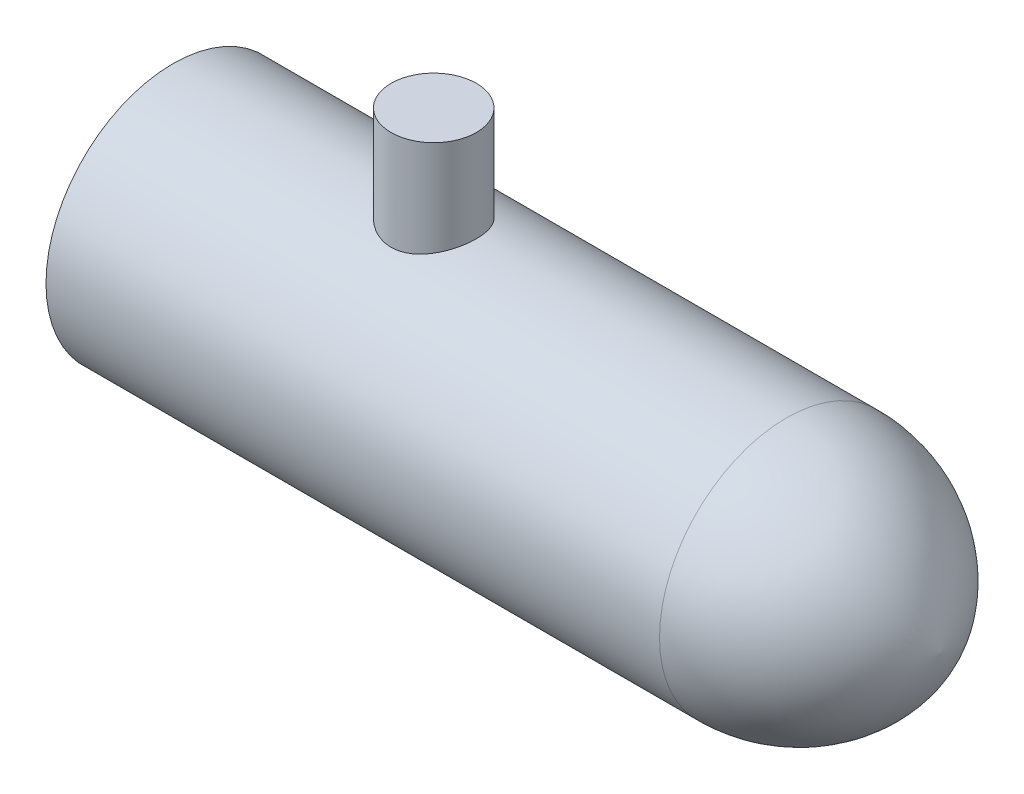
ISO-10303-21;
HEADER;
FILE_DESCRIPTION(('STEP AP214'),'2;1');
FILE_NAME('part.step','',(''),(''),'','','');
FILE_SCHEMA(('AUTOMOTIVE_DESIGN { 1 0 10303 214 1 1 1 1 }'));
ENDSEC;
DATA;
#1=APPLICATION_CONTEXT('core data for automotive mechanical design processes');
#2=APPLICATION_PROTOCOL_DEFINITION('international standard','automotive_design',2000,#1);
#3=PRODUCT_CONTEXT('',#1,'mechanical');
#4=PRODUCT('Part','Part','',(#3));
#5=PRODUCT_RELATED_PRODUCT_CATEGORY('part','',(#4));
#6=PRODUCT_DEFINITION_FORMATION('','',#4);
#7=PRODUCT_DEFINITION_CONTEXT('part definition',#1,'design');
#8=PRODUCT_DEFINITION('design','',#6,#7);
#9=PRODUCT_DEFINITION_SHAPE('','',#8);
#10=(LENGTH_UNIT() NAMED_UNIT(*) SI_UNIT(.MILLI.,.METRE.));
#11=(NAMED_UNIT(*) PLANE_ANGLE_UNIT() SI_UNIT($,.RADIAN.));
#12=(NAMED_UNIT(*) SI_UNIT($,.STERADIAN.) SOLID_ANGLE_UNIT());
#13=UNCERTAINTY_MEASURE_WITH_UNIT(LENGTH_MEASURE(1.E-05),#10,'distance_accuracy_value','');
#14=(GEOMETRIC_REPRESENTATION_CONTEXT(3) GLOBAL_UNCERTAINTY_ASSIGNED_CONTEXT((#13)) GLOBAL_UNIT_ASSIGNED_CONTEXT((#10,
#11,#12)) REPRESENTATION_CONTEXT('',''));
#15=CARTESIAN_POINT('',(0.,0.,0.));
#16=DIRECTION('',(0.,0.,1.));
#17=DIRECTION('',(1.,0.,0.));
#18=AXIS2_PLACEMENT_3D('',#15,#16,#17);
#19=CARTESIAN_POINT('',(127.,0.,0.));
#20=DIRECTION('',(-1.,0.,0.));
#21=DIRECTION('',(0.,0.,1.));
#22=AXIS2_PLACEMENT_3D('',#19,#20,#21);
#23=CYLINDRICAL_SURFACE('',#22,52.5526);
#24=CARTESIAN_POINT('',(-127.,0.,0.));
#25=DIRECTION('',(1.,0.,0.));
#26=DIRECTION('',(0.,0.,-1.));
#27=AXIS2_PLACEMENT_3D('',#24,#25,#26);
#28=CIRCLE('',#27,52.5526);
#29=CARTESIAN_POINT('',(-127.,0.,-52.5526));
#30=VERTEX_POINT('',#29);
#31=EDGE_CURVE('E66',#30,#30,#28,.T.);
#32=ORIENTED_EDGE('',*,*,#31,.T.);
#33=EDGE_LOOP('',(#32));
#34=FACE_BOUND('',#33,.T.);
#35=CARTESIAN_POINT('',(127.,0.,0.));
#36=DIRECTION('',(1.,0.,0.));
#37=DIRECTION('',(0.,0.,-1.));
#38=AXIS2_PLACEMENT_3D('',#35,#36,#37);
#39=CIRCLE('',#38,52.5526);
#40=CARTESIAN_POINT('',(127.,0.,-52.5526));
#41=VERTEX_POINT('',#40);
#42=EDGE_CURVE('E42',#41,#41,#39,.T.);
#43=ORIENTED_EDGE('',*,*,#42,.F.);
#44=EDGE_LOOP('',(#43));
#45=FACE_BOUND('',#44,.T.);
#46=CARTESIAN_POINT('',(-19.05,49.4989631988388,-17.653));
#47=CARTESIAN_POINT('',(-19.5305260048228,49.4989629532324,-17.6530003082304));
#48=CARTESIAN_POINT('',(-20.0110474586586,49.5059794142483,-17.6333633960385));
#49=CARTESIAN_POINT('',(-20.9684821638935,49.5338162332793,-17.5550145880757));
#50=CARTESIAN_POINT('',(-21.4453954572483,49.5546364305336,-17.4963031473733));
#51=CARTESIAN_POINT('',(-22.3921661941269,49.6094147409097,-17.3403732483805));
#52=CARTESIAN_POINT('',(-22.8620227875716,49.6433744238885,-17.2431501888318));
#53=CARTESIAN_POINT('',(-23.7912995671936,49.7233642483415,-17.0111095856218));
#54=CARTESIAN_POINT('',(-24.2507196509257,49.7693945082454,-16.8762916731));
#55=CARTESIAN_POINT('',(-25.1551030493514,49.8720178528158,-16.5705618405421));
#56=CARTESIAN_POINT('',(-25.6000938737013,49.9285892577525,-16.3997239088519));
#57=CARTESIAN_POINT('',(-26.4737745049151,50.0507007402627,-16.0231790848202));
#58=CARTESIAN_POINT('',(-26.9024643654421,50.116240788308,-15.8174723072796));
#59=CARTESIAN_POINT('',(-27.7410381403015,50.2544566606239,-15.372688975609));
#60=CARTESIAN_POINT('',(-28.1509191440249,50.3271335838751,-15.1336072798026));
#61=CARTESIAN_POINT('',(-28.9494721893862,50.477649546087,-14.6237240047705));
#62=CARTESIAN_POINT('',(-29.3381429208039,50.5554889032896,-14.3529204692383));
#63=CARTESIAN_POINT('',(-30.105689106652,50.7171550755363,-13.7709974847895));
#64=CARTESIAN_POINT('',(-30.4837053213106,50.8010965881028,-13.4587760333103));
#65=CARTESIAN_POINT('',(-31.2123521024094,50.9700356497915,-12.8041200380869));
#66=CARTESIAN_POINT('',(-31.5629820891438,51.055033221224,-12.4616848551115));
#67=CARTESIAN_POINT('',(-32.2347668620751,51.2238195890739,-11.748629782362));
#68=CARTESIAN_POINT('',(-32.5559164399133,51.3076081697011,-11.3780049333358));
#69=CARTESIAN_POINT('',(-33.166598905442,51.4717320940753,-10.6108622952378));
#70=CARTESIAN_POINT('',(-33.4561327432055,51.552067541547,-10.2143452848142));
#71=CARTESIAN_POINT('',(-34.0088870602722,51.7092212805486,-9.38691533446949));
#72=CARTESIAN_POINT('',(-34.2712013772305,51.7858889187284,-8.95536758787141));
#73=CARTESIAN_POINT('',(-34.7583930256163,51.9311744843795,-8.07031378102594));
#74=CARTESIAN_POINT('',(-34.9832694983149,51.9997922271961,-7.61680721740708));
#75=CARTESIAN_POINT('',(-35.3936366556601,52.1269963633454,-6.69105653530741));
#76=CARTESIAN_POINT('',(-35.5791356845668,52.1855848814061,-6.21881641177716));
#77=CARTESIAN_POINT('',(-35.9091060056045,52.2910350591554,-5.25894263959737));
#78=CARTESIAN_POINT('',(-36.0535790839836,52.3378972293924,-4.77130966217203));
#79=CARTESIAN_POINT('',(-36.2957404579975,52.4170802315864,-3.80179177378046));
#80=CARTESIAN_POINT('',(-36.3948997345633,52.4498558261846,-3.32031120238063));
#81=CARTESIAN_POINT('',(-36.5527770729487,52.5022761670325,-2.3500553748456));
#82=CARTESIAN_POINT('',(-36.6114960009825,52.5219211945329,-1.86128027518505));
#83=CARTESIAN_POINT('',(-36.6878996032651,52.5475171877741,-0.880285902860969));
#84=CARTESIAN_POINT('',(-36.7055935077917,52.5534712338656,-0.388067429929154));
#85=CARTESIAN_POINT('',(-36.6997936331135,52.5515229015678,0.596093465590439));
#86=CARTESIAN_POINT('',(-36.676300824031,52.5436208495485,1.08803589440721));
#87=CARTESIAN_POINT('',(-36.5901262788203,52.5147772968123,2.04827139178186));
#88=CARTESIAN_POINT('',(-36.5290448840084,52.4943684179944,2.51672515757799));
#89=CARTESIAN_POINT('',(-36.3697032119262,52.4415277285783,3.44655975563729));
#90=CARTESIAN_POINT('',(-36.2714441011002,52.4090962951862,3.90794080933304));
#91=CARTESIAN_POINT('',(-36.0386096296896,52.3330499850577,4.82051035603774));
#92=CARTESIAN_POINT('',(-35.9040329213144,52.2894346932775,5.27169847010062));
#93=CARTESIAN_POINT('',(-35.5996906935615,52.1921339319114,6.16092522971633));
#94=CARTESIAN_POINT('',(-35.429924384959,52.1384482364712,6.59896358009681));
#95=CARTESIAN_POINT('',(-35.054069474846,52.0215848095426,7.46484160145619));
#96=CARTESIAN_POINT('',(-34.8475305644515,51.9582910271362,7.89247002884542));
#97=CARTESIAN_POINT('',(-34.4012494717337,51.8243468694953,8.72881566924354));
#98=CARTESIAN_POINT('',(-34.1615071654825,51.7536964668033,9.13753281166059));
#99=CARTESIAN_POINT('',(-33.6504292948141,51.6067824374806,9.93376677166329));
#100=CARTESIAN_POINT('',(-33.3790868818001,51.5305175953716,10.3212789667157));
#101=CARTESIAN_POINT('',(-32.8065910408146,51.3742672079718,11.072840123111));
#102=CARTESIAN_POINT('',(-32.5054358712761,51.2942814454615,11.4368877116723));
#103=CARTESIAN_POINT('',(-31.8600697664396,51.1286945292606,12.1562756413503));
#104=CARTESIAN_POINT('',(-31.5144890371448,51.043007688898,12.5103685350521));
#105=CARTESIAN_POINT('',(-30.7947776857458,50.8720453028093,13.1883676350565));
#106=CARTESIAN_POINT('',(-30.4206461496407,50.7867697703435,13.5122728742194));
#107=CARTESIAN_POINT('',(-29.6460550877503,50.6189765870499,14.1278731592793));
#108=CARTESIAN_POINT('',(-29.2455907077052,50.5364594489639,14.4195622396656));
#109=CARTESIAN_POINT('',(-28.4208603148094,50.376549804956,14.9686604079249));
#110=CARTESIAN_POINT('',(-27.9965953481441,50.2991570741098,15.2260710008773));
#111=CARTESIAN_POINT('',(-27.1204628721498,50.1506794767551,15.7082694432515));
#112=CARTESIAN_POINT('',(-26.6682802770921,50.0797046328007,15.9325194311845));
#113=CARTESIAN_POINT('',(-25.7451373823873,49.9476084178934,16.341924187645));
#114=CARTESIAN_POINT('',(-25.2741767929538,49.8864871990775,16.5270783525588));
#115=CARTESIAN_POINT('',(-24.3169982366921,49.776126325458,16.8565483599118));
#116=CARTESIAN_POINT('',(-23.8307856778713,49.7268825118225,17.0008784998068));
#117=CARTESIAN_POINT('',(-22.8466282890408,49.6419328248548,17.2473565736121));
#118=CARTESIAN_POINT('',(-22.348684076878,49.6062262402705,17.3495067237036));
#119=CARTESIAN_POINT('',(-21.3679931030143,49.5509014474553,17.5068716337016));
#120=CARTESIAN_POINT('',(-20.8855932286939,49.5306219564494,17.564019809731));
#121=CARTESIAN_POINT('',(-19.9173421141814,49.5041966202527,17.6383632989964));
#122=CARTESIAN_POINT('',(-19.4314909795848,49.4980503444914,17.6555598293653));
#123=CARTESIAN_POINT('',(-18.4601396769927,49.5000953392603,17.6498252870763));
#124=CARTESIAN_POINT('',(-17.9746394642282,49.5082842377191,17.6269008533189));
#125=CARTESIAN_POINT('',(-17.0076248872328,49.5387233225306,17.5411721735903));
#126=CARTESIAN_POINT('',(-16.526110472625,49.560973330888,17.4783684324388));
#127=CARTESIAN_POINT('',(-15.5874809088415,49.6177857023735,17.3164133050624));
#128=CARTESIAN_POINT('',(-15.1301030240024,49.6518878301719,17.2186170331622));
#129=CARTESIAN_POINT('',(-14.2254897064702,49.731481450321,16.9873616475416));
#130=CARTESIAN_POINT('',(-13.7782539810417,49.77697261349,16.8539035645607));
#131=CARTESIAN_POINT('',(-12.8967123773343,49.8780364163562,16.5524168298574));
#132=CARTESIAN_POINT('',(-12.4624081985055,49.9336103743756,16.3843836570673));
#133=CARTESIAN_POINT('',(-11.6094012494533,50.0532865731965,16.0150531565084));
#134=CARTESIAN_POINT('',(-11.1906990034913,50.1173891002477,15.8137547121819));
#135=CARTESIAN_POINT('',(-10.3581543440956,50.2545677270926,15.3723543998797));
#136=CARTESIAN_POINT('',(-9.94489853217033,50.3278656989315,15.1312150424022));
#137=CARTESIAN_POINT('',(-9.13998388506491,50.4796941749533,14.6167082349323));
#138=CARTESIAN_POINT('',(-8.74832539415971,50.5582247625034,14.3433402714134));
#139=CARTESIAN_POINT('',(-7.9887344047771,50.7184489836257,13.7660606823625));
#140=CARTESIAN_POINT('',(-7.6208080752419,50.8001434308508,13.4621411673618));
#141=CARTESIAN_POINT('',(-6.91087534894005,50.9645605547226,12.8256523836894));
#142=CARTESIAN_POINT('',(-6.56886956701282,51.0472832557056,12.4930824358245));
#143=CARTESIAN_POINT('',(-5.89666196779213,51.2156873633086,11.784236347831));
#144=CARTESIAN_POINT('',(-5.56786164980434,51.3013149078072,11.4066166274879));
#145=CARTESIAN_POINT('',(-4.943162141852,51.4690166050539,10.6243168020338));
#146=CARTESIAN_POINT('',(-4.64726409683638,51.5510906340844,10.2196357560139));
#147=CARTESIAN_POINT('',(-4.09048600451773,51.7094107699158,9.38576954193084));
#148=CARTESIAN_POINT('',(-3.82960585349636,51.7856568939778,8.95658444645064));
#149=CARTESIAN_POINT('',(-3.34487805322687,51.9301903844258,8.07650365774247));
#150=CARTESIAN_POINT('',(-3.12102960281029,51.9984779229837,7.62560843447838));
#151=CARTESIAN_POINT('',(-2.71355141181284,52.1247504748816,6.70814140383632));
#152=CARTESIAN_POINT('',(-2.52967094679409,52.1827992566682,6.24168982961206));
#153=CARTESIAN_POINT('',(-2.20194279661229,52.2874770539158,5.29366602232385));
#154=CARTESIAN_POINT('',(-2.05809516401553,52.3341060543817,4.81209376940616));
#155=CARTESIAN_POINT('',(-1.81184474542851,52.4145762528024,3.83756646924434));
#156=CARTESIAN_POINT('',(-1.70942936716601,52.4484213358937,3.34461492866244));
#157=CARTESIAN_POINT('',(-1.54701722723492,52.502341619747,2.35103447011388));
#158=CARTESIAN_POINT('',(-1.48701860490198,52.5224174245146,1.8504058898946));
#159=CARTESIAN_POINT('',(-1.41189596467533,52.5475870533606,0.869483097616853));
#160=CARTESIAN_POINT('',(-1.39476723498748,52.5533500757475,0.389358507138945));
#161=CARTESIAN_POINT('',(-1.39969825714713,52.5516935612094,-0.570656921693795));
#162=CARTESIAN_POINT('',(-1.42175668223769,52.5442744705903,-1.05054776741227));
#163=CARTESIAN_POINT('',(-1.5048444310666,52.5164575861785,-2.00651728905968));
#164=CARTESIAN_POINT('',(-1.56587052419689,52.4960608682944,-2.48259627769737));
#165=CARTESIAN_POINT('',(-1.72631370669081,52.4428426406368,-3.42753040314198));
#166=CARTESIAN_POINT('',(-1.82573088887569,52.4100211008229,-3.89638552248031));
#167=CARTESIAN_POINT('',(-2.060108966688,52.3334664361127,-4.81595874250626));
#168=CARTESIAN_POINT('',(-2.19446028775054,52.2899210636899,-5.26684818122525));
#169=CARTESIAN_POINT('',(-2.49829888194531,52.1927721009386,-6.15549378992734));
#170=CARTESIAN_POINT('',(-2.66778557644833,52.1391686762531,-6.59325017605708));
#171=CARTESIAN_POINT('',(-3.04059024408549,52.0232369609472,-7.45297063350527));
#172=CARTESIAN_POINT('',(-3.2439127047247,51.9609075132029,-7.87493260096695));
#173=CARTESIAN_POINT('',(-3.68289081202383,51.8290612218567,-8.70051481434604));
#174=CARTESIAN_POINT('',(-3.91854749337005,51.7595441482704,-9.1041344727641));
#175=CARTESIAN_POINT('',(-4.42996828882149,51.6123096830446,-9.90541905669726));
#176=CARTESIAN_POINT('',(-4.7069006500743,51.5343831236761,-10.3023001478605));
#177=CARTESIAN_POINT('',(-5.29196656130133,51.374620831495,-11.0715149537279));
#178=CARTESIAN_POINT('',(-5.60010078862073,51.2927850138388,-11.4438481352444));
#179=CARTESIAN_POINT('',(-6.24571532706285,51.1272892024678,-12.1619025325651));
#180=CARTESIAN_POINT('',(-6.58320421625972,51.0436286809221,-12.5076159134648));
#181=CARTESIAN_POINT('',(-7.28542006291579,50.8766784240879,-13.1702747062203));
#182=CARTESIAN_POINT('',(-7.6501473703436,50.793388693578,-13.4872197483345));
#183=CARTESIAN_POINT('',(-8.41981629606579,50.6260952244112,-14.102479541039));
#184=CARTESIAN_POINT('',(-8.82578285790284,50.5421961538599,-14.3995422277025));
#185=CARTESIAN_POINT('',(-9.66233574248843,50.3796316292146,-14.9583824940466));
#186=CARTESIAN_POINT('',(-10.0929229290308,50.3009663589538,-15.2201588346524));
#187=CARTESIAN_POINT('',(-10.9758569848995,50.1512704933782,-15.7063860482266));
#188=CARTESIAN_POINT('',(-11.428199795944,50.0802384820941,-15.9308438480248));
#189=CARTESIAN_POINT('',(-12.3516658031489,49.9480359221968,-16.340620121607));
#190=CARTESIAN_POINT('',(-12.8227880635384,49.8868648829803,-16.5259405426969));
#191=CARTESIAN_POINT('',(-13.7612872147314,49.7786035104617,-16.8491628162279));
#192=CARTESIAN_POINT('',(-14.2280590296425,49.7310475264053,-16.9886659495384));
#193=CARTESIAN_POINT('',(-15.1725814828251,49.6483682826003,-17.2287971432793));
#194=CARTESIAN_POINT('',(-15.6503317876854,49.6132446458175,-17.3294263826421));
#195=CARTESIAN_POINT('',(-16.6131739276796,49.5565798802893,-17.4908115615436));
#196=CARTESIAN_POINT('',(-17.0982634829024,49.5350346187171,-17.5515796337877));
#197=CARTESIAN_POINT('',(-18.0722369540079,49.5062264735932,-17.63267349613));
#198=CARTESIAN_POINT('',(-18.5611208322966,49.4989634487148,-17.6529996864116));
#199=CARTESIAN_POINT('',(-19.05,49.4989631988388,-17.653));
#200=B_SPLINE_CURVE_WITH_KNOTS('',3,(#46,#47,#48,#49,#50,#51,#52,#53,#54,#55,#56,#57,#58,#59,
#60,#61,#62,#63,#64,#65,#66,#67,#68,#69,#70,#71,#72,#73,#74,#75,#76,#77,#78,#79,#80,#81,#82,#83,
#84,#85,#86,#87,#88,#89,#90,#91,#92,#93,#94,#95,#96,#97,#98,#99,#100,#101,#102,#103,#104,#105,
#106,#107,#108,#109,#110,#111,#112,#113,#114,#115,#116,#117,#118,#119,#120,#121,#122,#123,#124,
#125,#126,#127,#128,#129,#130,#131,#132,#133,#134,#135,#136,#137,#138,#139,#140,#141,#142,#143,
#144,#145,#146,#147,#148,#149,#150,#151,#152,#153,#154,#155,#156,#157,#158,#159,#160,#161,#162,
#163,#164,#165,#166,#167,#168,#169,#170,#171,#172,#173,#174,#175,#176,#177,#178,#179,#180,#181,
#182,#183,#184,#185,#186,#187,#188,#189,#190,#191,#192,#193,#194,#195,#196,#197,#198,#199),
.UNSPECIFIED.,.T.,.F.,(4,2,2,2,2,2,2,2,2,2,2,2,2,2,2,2,2,2,2,2,2,2,2,2,2,2,2,2,2,2,2,2,2,2,2,2,
2,2,2,2,2,2,2,2,2,2,2,2,2,2,2,2,2,2,2,2,2,2,2,2,2,2,2,2,2,2,2,2,2,2,2,2,2,2,2,2,4),(0.,
1.44112031493301,2.88222384663087,4.323499609217,5.76478951331909,7.20314722912156,
8.64150020941933,10.0800750246856,11.5187386045467,13.0093041356322,14.4999012101472,
15.9907611264231,17.4815762290829,19.012095763362,20.5426503990297,22.0728803787096,
23.6030437227701,25.0792130214696,26.5553507003022,28.0311562286009,29.5069269958658,
30.9238395826856,32.3407077178116,33.7576284418845,35.174580947788,36.6102565730068,
38.0459375568682,39.4819302726655,40.9180069241776,42.4227099010095,43.9274610683369,
45.4324904070134,46.9374536419516,48.4646402715415,49.9918504781638,51.5185251586343,
53.0451196157959,54.5018752734425,55.958586550221,57.4150568047079,58.8715086225622,
60.2767697618632,61.6819902890491,63.0873946809555,64.4928462552243,65.9433758788825,
67.393928618217,68.8448569074864,70.295819602236,71.8179418521375,73.340117053007,
74.8622877452963,76.3844255016243,77.8967199254094,79.409016334948,80.920852774814,
82.4326228919576,83.8722542570748,85.3118368816163,86.7513001732925,88.1907669452979,
89.606629488523,91.0224687163745,92.438495871305,93.8545683492932,95.323467037555,
96.792397620218,98.2617589080103,99.7311390779138,101.259285775388,102.787486119536,
104.315402491426,105.843242822913,107.309920274496,108.776553242522,110.242739598119,
111.708911445332),.UNSPECIFIED.);
#201=CARTESIAN_POINT('',(-19.05,49.4989631988388,-17.653));
#202=VERTEX_POINT('',#201);
#203=EDGE_CURVE('E11',#202,#202,#200,.T.);
#204=ORIENTED_EDGE('',*,*,#203,.F.);
#205=EDGE_LOOP('',(#204));
#206=FACE_BOUND('',#205,.T.);
#207=ADVANCED_FACE('F32',(#34,#45,#206),#23,.T.);
#208=CARTESIAN_POINT('',(-127.,0.,0.));
#209=DIRECTION('',(1.,0.,0.));
#210=DIRECTION('',(0.,0.,-1.));
#211=AXIS2_PLACEMENT_3D('',#208,#209,#210);
#212=PLANE('',#211);
#213=ORIENTED_EDGE('',*,*,#31,.F.);
#214=EDGE_LOOP('',(#213));
#215=FACE_BOUND('',#214,.T.);
#216=ADVANCED_FACE('F48',(#215),#212,.F.);
#217=CARTESIAN_POINT('',(127.,0.,-12.0876439342678));
#218=DIRECTION('',(0.,-1.,0.));
#219=DIRECTION('',(0.,0.,1.));
#220=AXIS2_PLACEMENT_3D('',#217,#218,#219);
#221=CIRCLE('',#220,64.6402439342678);
#222=TRIMMED_CURVE('',#221,(PARAMETER_VALUE(-1.38269023004621)),
(PARAMETER_VALUE(1.38269023004621)),.T.,.PARAMETER.);
#223=CARTESIAN_POINT('',(127.,0.,0.));
#224=DIRECTION('',(-1.,0.,0.));
#225=AXIS1_PLACEMENT('',#223,#224);
#226=SURFACE_OF_REVOLUTION('',#222,#225);
#227=ORIENTED_EDGE('',*,*,#42,.T.);
#228=EDGE_LOOP('',(#227));
#229=FACE_BOUND('',#228,.T.);
#230=CARTESIAN_POINT('',(190.5,0.,0.));
#231=VERTEX_POINT('',#230);
#232=VERTEX_LOOP('',#231);
#233=FACE_BOUND('',#232,.T.);
#234=ADVANCED_FACE('F45',(#229,#233),#226,.T.);
#235=CARTESIAN_POINT('',(-19.05,90.6526,0.));
#236=DIRECTION('',(0.,-1.,0.));
#237=DIRECTION('',(0.,0.,-1.));
#238=AXIS2_PLACEMENT_3D('',#235,#236,#237);
#239=CYLINDRICAL_SURFACE('',#238,17.653);
#240=CARTESIAN_POINT('',(-19.05,90.6526,0.));
#241=DIRECTION('',(0.,1.,0.));
#242=DIRECTION('',(0.,0.,1.));
#243=AXIS2_PLACEMENT_3D('',#240,#241,#242);
#244=CIRCLE('',#243,17.653);
#245=CARTESIAN_POINT('',(-19.05,90.6526,17.653));
#246=VERTEX_POINT('',#245);
#247=EDGE_CURVE('E72',#246,#246,#244,.T.);
#248=ORIENTED_EDGE('',*,*,#247,.F.);
#249=EDGE_LOOP('',(#248));
#250=FACE_BOUND('',#249,.T.);
#251=ORIENTED_EDGE('',*,*,#203,.T.);
#252=EDGE_LOOP('',(#251));
#253=FACE_BOUND('',#252,.T.);
#254=ADVANCED_FACE('F47',(#250,#253),#239,.T.);
#255=CARTESIAN_POINT('',(-19.05,90.6526,0.));
#256=DIRECTION('',(0.,1.,0.));
#257=DIRECTION('',(0.,0.,1.));
#258=AXIS2_PLACEMENT_3D('',#255,#256,#257);
#259=PLANE('',#258);
#260=ORIENTED_EDGE('',*,*,#247,.T.);
#261=EDGE_LOOP('',(#260));
#262=FACE_BOUND('',#261,.T.);
#263=ADVANCED_FACE('F55',(#262),#259,.T.);
#264=CLOSED_SHELL('',(#207,#216,#234,#254,#263));
#265=MANIFOLD_SOLID_BREP('B2',#264);
#266=ADVANCED_BREP_SHAPE_REPRESENTATION('',(#18,#265),#14);
#267=SHAPE_DEFINITION_REPRESENTATION(#9,#266);
ENDSEC;
END-ISO-10303-21;
